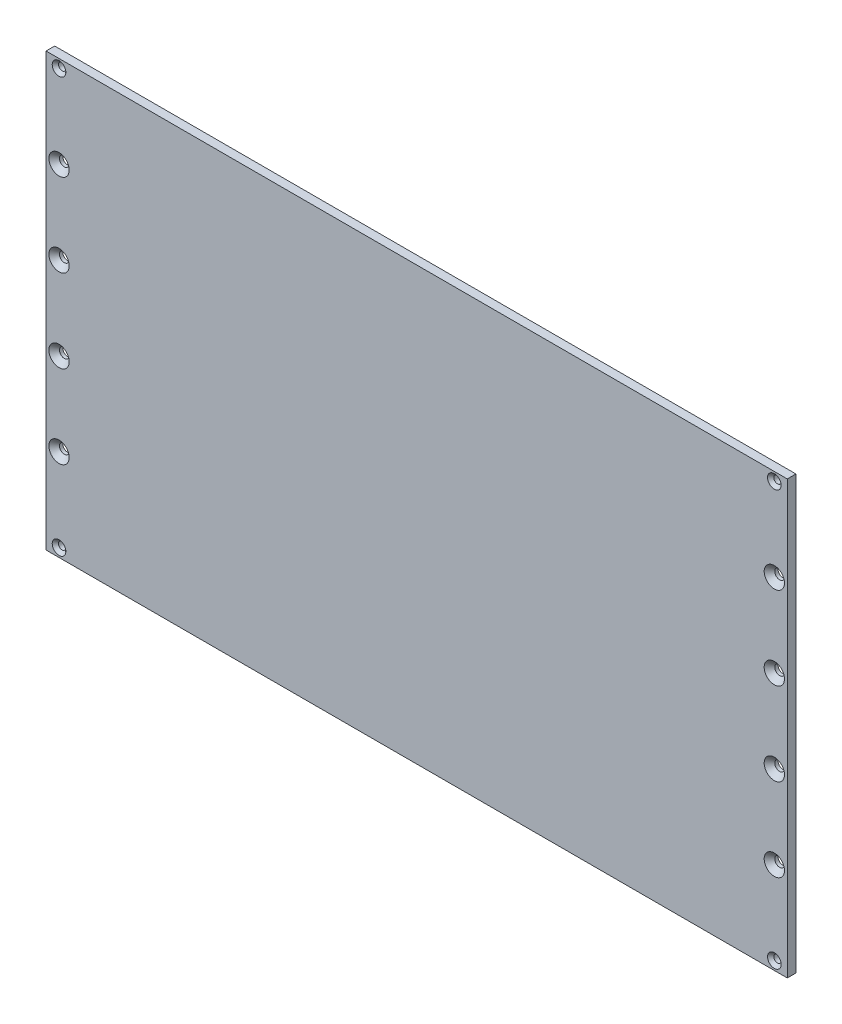
ISO-10303-21;
HEADER;
FILE_DESCRIPTION(('STEP AP214'),'2;1');
FILE_NAME('part.step','',(''),(''),'','','');
FILE_SCHEMA(('AUTOMOTIVE_DESIGN { 1 0 10303 214 1 1 1 1 }'));
ENDSEC;
DATA;
#1=APPLICATION_CONTEXT('core data for automotive mechanical design processes');
#2=APPLICATION_PROTOCOL_DEFINITION('international standard','automotive_design',2000,#1);
#3=PRODUCT_CONTEXT('',#1,'mechanical');
#4=PRODUCT('Part','Part','',(#3));
#5=PRODUCT_RELATED_PRODUCT_CATEGORY('part','',(#4));
#6=PRODUCT_DEFINITION_FORMATION('','',#4);
#7=PRODUCT_DEFINITION_CONTEXT('part definition',#1,'design');
#8=PRODUCT_DEFINITION('design','',#6,#7);
#9=PRODUCT_DEFINITION_SHAPE('','',#8);
#10=(LENGTH_UNIT() NAMED_UNIT(*) SI_UNIT(.MILLI.,.METRE.));
#11=(NAMED_UNIT(*) PLANE_ANGLE_UNIT() SI_UNIT($,.RADIAN.));
#12=(NAMED_UNIT(*) SI_UNIT($,.STERADIAN.) SOLID_ANGLE_UNIT());
#13=UNCERTAINTY_MEASURE_WITH_UNIT(LENGTH_MEASURE(1.E-05),#10,'distance_accuracy_value','');
#14=(GEOMETRIC_REPRESENTATION_CONTEXT(3) GLOBAL_UNCERTAINTY_ASSIGNED_CONTEXT((#13)) GLOBAL_UNIT_ASSIGNED_CONTEXT((#10,
#11,#12)) REPRESENTATION_CONTEXT('',''));
#15=CARTESIAN_POINT('',(0.,0.,0.));
#16=DIRECTION('',(0.,0.,1.));
#17=DIRECTION('',(1.,0.,0.));
#18=AXIS2_PLACEMENT_3D('',#15,#16,#17);
#19=CARTESIAN_POINT('',(0.,200.,0.));
#20=DIRECTION('',(0.,0.,-1.));
#21=DIRECTION('',(-1.,0.,0.));
#22=AXIS2_PLACEMENT_3D('',#19,#20,#21);
#23=PLANE('',#22);
#24=CARTESIAN_POINT('',(337.,157.6,0.));
#25=DIRECTION('',(0.,0.,1.));
#26=DIRECTION('',(1.,0.,0.));
#27=AXIS2_PLACEMENT_3D('',#24,#25,#26);
#28=CIRCLE('',#27,2.24999999999997);
#29=CARTESIAN_POINT('',(339.25,157.6,0.));
#30=VERTEX_POINT('',#29);
#31=EDGE_CURVE('E204',#30,#30,#28,.T.);
#32=ORIENTED_EDGE('',*,*,#31,.T.);
#33=EDGE_LOOP('',(#32));
#34=FACE_BOUND('',#33,.T.);
#35=CARTESIAN_POINT('',(337.,119.2,0.));
#36=DIRECTION('',(0.,0.,1.));
#37=DIRECTION('',(1.,0.,0.));
#38=AXIS2_PLACEMENT_3D('',#35,#36,#37);
#39=CIRCLE('',#38,2.24999999999997);
#40=CARTESIAN_POINT('',(339.25,119.2,0.));
#41=VERTEX_POINT('',#40);
#42=EDGE_CURVE('E186',#41,#41,#39,.T.);
#43=ORIENTED_EDGE('',*,*,#42,.T.);
#44=EDGE_LOOP('',(#43));
#45=FACE_BOUND('',#44,.T.);
#46=CARTESIAN_POINT('',(337.,80.8,0.));
#47=DIRECTION('',(0.,0.,1.));
#48=DIRECTION('',(1.,0.,0.));
#49=AXIS2_PLACEMENT_3D('',#46,#47,#48);
#50=CIRCLE('',#49,2.24999999999997);
#51=CARTESIAN_POINT('',(339.25,80.8,0.));
#52=VERTEX_POINT('',#51);
#53=EDGE_CURVE('E168',#52,#52,#50,.T.);
#54=ORIENTED_EDGE('',*,*,#53,.T.);
#55=EDGE_LOOP('',(#54));
#56=FACE_BOUND('',#55,.T.);
#57=CARTESIAN_POINT('',(337.,42.4,0.));
#58=DIRECTION('',(0.,0.,1.));
#59=DIRECTION('',(1.,0.,0.));
#60=AXIS2_PLACEMENT_3D('',#57,#58,#59);
#61=CIRCLE('',#60,2.24999999999997);
#62=CARTESIAN_POINT('',(339.25,42.4,0.));
#63=VERTEX_POINT('',#62);
#64=EDGE_CURVE('E150',#63,#63,#61,.T.);
#65=ORIENTED_EDGE('',*,*,#64,.T.);
#66=EDGE_LOOP('',(#65));
#67=FACE_BOUND('',#66,.T.);
#68=CARTESIAN_POINT('',(6.,4.,0.));
#69=DIRECTION('',(0.,0.,1.));
#70=DIRECTION('',(1.,0.,0.));
#71=AXIS2_PLACEMENT_3D('',#68,#69,#70);
#72=CIRCLE('',#71,1.7);
#73=CARTESIAN_POINT('',(7.7,4.,0.));
#74=VERTEX_POINT('',#73);
#75=EDGE_CURVE('E132',#74,#74,#72,.T.);
#76=ORIENTED_EDGE('',*,*,#75,.T.);
#77=EDGE_LOOP('',(#76));
#78=FACE_BOUND('',#77,.T.);
#79=CARTESIAN_POINT('',(337.,196.,0.));
#80=DIRECTION('',(0.,0.,1.));
#81=DIRECTION('',(1.,0.,0.));
#82=AXIS2_PLACEMENT_3D('',#79,#80,#81);
#83=CIRCLE('',#82,1.69999999999998);
#84=CARTESIAN_POINT('',(338.7,196.,0.));
#85=VERTEX_POINT('',#84);
#86=EDGE_CURVE('E114',#85,#85,#83,.T.);
#87=ORIENTED_EDGE('',*,*,#86,.T.);
#88=EDGE_LOOP('',(#87));
#89=FACE_BOUND('',#88,.T.);
#90=DIRECTION('',(0.,-1.,0.));
#91=VECTOR('',#90,1.);
#92=CARTESIAN_POINT('',(0.,0.,0.));
#93=LINE('',#92,#91);
#94=CARTESIAN_POINT('',(0.,200.,0.));
#95=VERTEX_POINT('',#94);
#96=CARTESIAN_POINT('',(0.,0.,0.));
#97=VERTEX_POINT('',#96);
#98=EDGE_CURVE('E95',#95,#97,#93,.T.);
#99=ORIENTED_EDGE('',*,*,#98,.F.);
#100=DIRECTION('',(-1.,0.,0.));
#101=VECTOR('',#100,1.);
#102=CARTESIAN_POINT('',(0.,200.,0.));
#103=LINE('',#102,#101);
#104=CARTESIAN_POINT('',(343.,200.,0.));
#105=VERTEX_POINT('',#104);
#106=EDGE_CURVE('E71',#105,#95,#103,.T.);
#107=ORIENTED_EDGE('',*,*,#106,.F.);
#108=DIRECTION('',(0.,1.,0.));
#109=VECTOR('',#108,1.);
#110=CARTESIAN_POINT('',(343.,0.,0.));
#111=LINE('',#110,#109);
#112=CARTESIAN_POINT('',(343.,0.,0.));
#113=VERTEX_POINT('',#112);
#114=EDGE_CURVE('E65',#113,#105,#111,.T.);
#115=ORIENTED_EDGE('',*,*,#114,.F.);
#116=DIRECTION('',(1.,0.,0.));
#117=VECTOR('',#116,1.);
#118=CARTESIAN_POINT('',(0.,0.,0.));
#119=LINE('',#118,#117);
#120=EDGE_CURVE('E87',#97,#113,#119,.T.);
#121=ORIENTED_EDGE('',*,*,#120,.F.);
#122=EDGE_LOOP('',(#99,#107,#115,#121));
#123=FACE_BOUND('',#122,.T.);
#124=CARTESIAN_POINT('',(337.,4.,0.));
#125=DIRECTION('',(0.,0.,1.));
#126=DIRECTION('',(1.,0.,0.));
#127=AXIS2_PLACEMENT_3D('',#124,#125,#126);
#128=CIRCLE('',#127,1.69999999999998);
#129=CARTESIAN_POINT('',(338.7,4.,0.));
#130=VERTEX_POINT('',#129);
#131=EDGE_CURVE('E123',#130,#130,#128,.T.);
#132=ORIENTED_EDGE('',*,*,#131,.T.);
#133=EDGE_LOOP('',(#132));
#134=FACE_BOUND('',#133,.T.);
#135=CARTESIAN_POINT('',(6.00000000000001,196.,0.));
#136=DIRECTION('',(0.,0.,1.));
#137=DIRECTION('',(1.,0.,0.));
#138=AXIS2_PLACEMENT_3D('',#135,#136,#137);
#139=CIRCLE('',#138,1.7);
#140=CARTESIAN_POINT('',(7.7,196.,0.));
#141=VERTEX_POINT('',#140);
#142=EDGE_CURVE('E141',#141,#141,#139,.T.);
#143=ORIENTED_EDGE('',*,*,#142,.T.);
#144=EDGE_LOOP('',(#143));
#145=FACE_BOUND('',#144,.T.);
#146=CARTESIAN_POINT('',(6.,42.4,0.));
#147=DIRECTION('',(0.,0.,1.));
#148=DIRECTION('',(1.,0.,0.));
#149=AXIS2_PLACEMENT_3D('',#146,#147,#148);
#150=CIRCLE('',#149,2.25);
#151=CARTESIAN_POINT('',(8.25,42.4,0.));
#152=VERTEX_POINT('',#151);
#153=EDGE_CURVE('E159',#152,#152,#150,.T.);
#154=ORIENTED_EDGE('',*,*,#153,.T.);
#155=EDGE_LOOP('',(#154));
#156=FACE_BOUND('',#155,.T.);
#157=CARTESIAN_POINT('',(6.,80.8,0.));
#158=DIRECTION('',(0.,0.,1.));
#159=DIRECTION('',(1.,0.,0.));
#160=AXIS2_PLACEMENT_3D('',#157,#158,#159);
#161=CIRCLE('',#160,2.25);
#162=CARTESIAN_POINT('',(8.25,80.8,0.));
#163=VERTEX_POINT('',#162);
#164=EDGE_CURVE('E177',#163,#163,#161,.T.);
#165=ORIENTED_EDGE('',*,*,#164,.T.);
#166=EDGE_LOOP('',(#165));
#167=FACE_BOUND('',#166,.T.);
#168=CARTESIAN_POINT('',(6.,119.2,0.));
#169=DIRECTION('',(0.,0.,1.));
#170=DIRECTION('',(1.,0.,0.));
#171=AXIS2_PLACEMENT_3D('',#168,#169,#170);
#172=CIRCLE('',#171,2.25);
#173=CARTESIAN_POINT('',(8.25,119.2,0.));
#174=VERTEX_POINT('',#173);
#175=EDGE_CURVE('E195',#174,#174,#172,.T.);
#176=ORIENTED_EDGE('',*,*,#175,.T.);
#177=EDGE_LOOP('',(#176));
#178=FACE_BOUND('',#177,.T.);
#179=CARTESIAN_POINT('',(6.,157.6,0.));
#180=DIRECTION('',(0.,0.,1.));
#181=DIRECTION('',(1.,0.,0.));
#182=AXIS2_PLACEMENT_3D('',#179,#180,#181);
#183=CIRCLE('',#182,2.25);
#184=CARTESIAN_POINT('',(8.25,157.6,0.));
#185=VERTEX_POINT('',#184);
#186=EDGE_CURVE('E213',#185,#185,#183,.T.);
#187=ORIENTED_EDGE('',*,*,#186,.T.);
#188=EDGE_LOOP('',(#187));
#189=FACE_BOUND('',#188,.T.);
#190=ADVANCED_FACE('F31',(#34,#45,#56,#67,#78,#89,#123,#134,#145,#156,#167,#178,#189),#23,.T.);
#191=CARTESIAN_POINT('',(0.,0.,4.));
#192=DIRECTION('',(1.,0.,0.));
#193=DIRECTION('',(0.,0.,-1.));
#194=AXIS2_PLACEMENT_3D('',#191,#192,#193);
#195=PLANE('',#194);
#196=ORIENTED_EDGE('',*,*,#98,.T.);
#197=DIRECTION('',(0.,0.,-1.));
#198=VECTOR('',#197,1.);
#199=CARTESIAN_POINT('',(0.,0.,4.));
#200=LINE('',#199,#198);
#201=CARTESIAN_POINT('',(0.,0.,4.));
#202=VERTEX_POINT('',#201);
#203=EDGE_CURVE('E11',#202,#97,#200,.T.);
#204=ORIENTED_EDGE('',*,*,#203,.F.);
#205=DIRECTION('',(0.,-1.,0.));
#206=VECTOR('',#205,1.);
#207=CARTESIAN_POINT('',(0.,0.,4.));
#208=LINE('',#207,#206);
#209=CARTESIAN_POINT('',(0.,200.,4.));
#210=VERTEX_POINT('',#209);
#211=EDGE_CURVE('E83',#210,#202,#208,.T.);
#212=ORIENTED_EDGE('',*,*,#211,.F.);
#213=DIRECTION('',(0.,0.,-1.));
#214=VECTOR('',#213,1.);
#215=CARTESIAN_POINT('',(0.,200.,4.));
#216=LINE('',#215,#214);
#217=EDGE_CURVE('E91',#210,#95,#216,.T.);
#218=ORIENTED_EDGE('',*,*,#217,.T.);
#219=EDGE_LOOP('',(#196,#204,#212,#218));
#220=FACE_BOUND('',#219,.T.);
#221=ADVANCED_FACE('F33',(#220),#195,.F.);
#222=CARTESIAN_POINT('',(0.,0.,4.));
#223=DIRECTION('',(0.,1.,0.));
#224=DIRECTION('',(0.,0.,1.));
#225=AXIS2_PLACEMENT_3D('',#222,#223,#224);
#226=PLANE('',#225);
#227=ORIENTED_EDGE('',*,*,#120,.T.);
#228=DIRECTION('',(0.,0.,-1.));
#229=VECTOR('',#228,1.);
#230=CARTESIAN_POINT('',(343.,0.,4.));
#231=LINE('',#230,#229);
#232=CARTESIAN_POINT('',(343.,0.,4.));
#233=VERTEX_POINT('',#232);
#234=EDGE_CURVE('E40',#233,#113,#231,.T.);
#235=ORIENTED_EDGE('',*,*,#234,.F.);
#236=DIRECTION('',(1.,0.,0.));
#237=VECTOR('',#236,1.);
#238=CARTESIAN_POINT('',(0.,0.,4.));
#239=LINE('',#238,#237);
#240=EDGE_CURVE('E78',#202,#233,#239,.T.);
#241=ORIENTED_EDGE('',*,*,#240,.F.);
#242=ORIENTED_EDGE('',*,*,#203,.T.);
#243=EDGE_LOOP('',(#227,#235,#241,#242));
#244=FACE_BOUND('',#243,.T.);
#245=ADVANCED_FACE('F86',(#244),#226,.F.);
#246=CARTESIAN_POINT('',(343.,0.,4.));
#247=DIRECTION('',(-1.,0.,0.));
#248=DIRECTION('',(0.,0.,1.));
#249=AXIS2_PLACEMENT_3D('',#246,#247,#248);
#250=PLANE('',#249);
#251=ORIENTED_EDGE('',*,*,#114,.T.);
#252=DIRECTION('',(0.,0.,-1.));
#253=VECTOR('',#252,1.);
#254=CARTESIAN_POINT('',(343.,200.,4.));
#255=LINE('',#254,#253);
#256=CARTESIAN_POINT('',(343.,200.,4.));
#257=VERTEX_POINT('',#256);
#258=EDGE_CURVE('E88',#257,#105,#255,.T.);
#259=ORIENTED_EDGE('',*,*,#258,.F.);
#260=DIRECTION('',(0.,1.,0.));
#261=VECTOR('',#260,1.);
#262=CARTESIAN_POINT('',(343.,0.,4.));
#263=LINE('',#262,#261);
#264=EDGE_CURVE('E81',#233,#257,#263,.T.);
#265=ORIENTED_EDGE('',*,*,#264,.F.);
#266=ORIENTED_EDGE('',*,*,#234,.T.);
#267=EDGE_LOOP('',(#251,#259,#265,#266));
#268=FACE_BOUND('',#267,.T.);
#269=ADVANCED_FACE('F89',(#268),#250,.F.);
#270=CARTESIAN_POINT('',(0.,200.,4.));
#271=DIRECTION('',(0.,-1.,0.));
#272=DIRECTION('',(0.,0.,-1.));
#273=AXIS2_PLACEMENT_3D('',#270,#271,#272);
#274=PLANE('',#273);
#275=ORIENTED_EDGE('',*,*,#106,.T.);
#276=ORIENTED_EDGE('',*,*,#217,.F.);
#277=DIRECTION('',(-1.,0.,0.));
#278=VECTOR('',#277,1.);
#279=CARTESIAN_POINT('',(0.,200.,4.));
#280=LINE('',#279,#278);
#281=EDGE_CURVE('E48',#257,#210,#280,.T.);
#282=ORIENTED_EDGE('',*,*,#281,.F.);
#283=ORIENTED_EDGE('',*,*,#258,.T.);
#284=EDGE_LOOP('',(#275,#276,#282,#283));
#285=FACE_BOUND('',#284,.T.);
#286=ADVANCED_FACE('F103',(#285),#274,.F.);
#287=CARTESIAN_POINT('',(0.,200.,4.));
#288=DIRECTION('',(0.,0.,-1.));
#289=DIRECTION('',(-1.,0.,0.));
#290=AXIS2_PLACEMENT_3D('',#287,#288,#289);
#291=PLANE('',#290);
#292=CARTESIAN_POINT('',(6.,157.6,4.));
#293=DIRECTION('',(0.,0.,1.));
#294=DIRECTION('',(1.,0.,0.));
#295=AXIS2_PLACEMENT_3D('',#292,#293,#294);
#296=CIRCLE('',#295,4.7);
#297=CARTESIAN_POINT('',(10.7,157.6,4.));
#298=VERTEX_POINT('',#297);
#299=EDGE_CURVE('E207',#298,#298,#296,.T.);
#300=ORIENTED_EDGE('',*,*,#299,.F.);
#301=EDGE_LOOP('',(#300));
#302=FACE_BOUND('',#301,.T.);
#303=CARTESIAN_POINT('',(337.,157.6,4.));
#304=DIRECTION('',(0.,0.,1.));
#305=DIRECTION('',(1.,0.,0.));
#306=AXIS2_PLACEMENT_3D('',#303,#304,#305);
#307=CIRCLE('',#306,4.69999999999998);
#308=CARTESIAN_POINT('',(341.7,157.6,4.));
#309=VERTEX_POINT('',#308);
#310=EDGE_CURVE('E198',#309,#309,#307,.T.);
#311=ORIENTED_EDGE('',*,*,#310,.F.);
#312=EDGE_LOOP('',(#311));
#313=FACE_BOUND('',#312,.T.);
#314=CARTESIAN_POINT('',(6.,119.2,4.));
#315=DIRECTION('',(0.,0.,1.));
#316=DIRECTION('',(1.,0.,0.));
#317=AXIS2_PLACEMENT_3D('',#314,#315,#316);
#318=CIRCLE('',#317,4.7);
#319=CARTESIAN_POINT('',(10.7,119.2,4.));
#320=VERTEX_POINT('',#319);
#321=EDGE_CURVE('E189',#320,#320,#318,.T.);
#322=ORIENTED_EDGE('',*,*,#321,.F.);
#323=EDGE_LOOP('',(#322));
#324=FACE_BOUND('',#323,.T.);
#325=CARTESIAN_POINT('',(337.,119.2,4.));
#326=DIRECTION('',(0.,0.,1.));
#327=DIRECTION('',(1.,0.,0.));
#328=AXIS2_PLACEMENT_3D('',#325,#326,#327);
#329=CIRCLE('',#328,4.69999999999998);
#330=CARTESIAN_POINT('',(341.7,119.2,4.));
#331=VERTEX_POINT('',#330);
#332=EDGE_CURVE('E180',#331,#331,#329,.T.);
#333=ORIENTED_EDGE('',*,*,#332,.F.);
#334=EDGE_LOOP('',(#333));
#335=FACE_BOUND('',#334,.T.);
#336=CARTESIAN_POINT('',(6.,80.8,4.));
#337=DIRECTION('',(0.,0.,1.));
#338=DIRECTION('',(1.,0.,0.));
#339=AXIS2_PLACEMENT_3D('',#336,#337,#338);
#340=CIRCLE('',#339,4.7);
#341=CARTESIAN_POINT('',(10.7,80.8,4.));
#342=VERTEX_POINT('',#341);
#343=EDGE_CURVE('E171',#342,#342,#340,.T.);
#344=ORIENTED_EDGE('',*,*,#343,.F.);
#345=EDGE_LOOP('',(#344));
#346=FACE_BOUND('',#345,.T.);
#347=CARTESIAN_POINT('',(337.,80.8,4.));
#348=DIRECTION('',(0.,0.,1.));
#349=DIRECTION('',(1.,0.,0.));
#350=AXIS2_PLACEMENT_3D('',#347,#348,#349);
#351=CIRCLE('',#350,4.69999999999998);
#352=CARTESIAN_POINT('',(341.7,80.8,4.));
#353=VERTEX_POINT('',#352);
#354=EDGE_CURVE('E162',#353,#353,#351,.T.);
#355=ORIENTED_EDGE('',*,*,#354,.F.);
#356=EDGE_LOOP('',(#355));
#357=FACE_BOUND('',#356,.T.);
#358=CARTESIAN_POINT('',(6.,42.4,4.));
#359=DIRECTION('',(0.,0.,1.));
#360=DIRECTION('',(1.,0.,0.));
#361=AXIS2_PLACEMENT_3D('',#358,#359,#360);
#362=CIRCLE('',#361,4.7);
#363=CARTESIAN_POINT('',(10.7,42.4,4.));
#364=VERTEX_POINT('',#363);
#365=EDGE_CURVE('E153',#364,#364,#362,.T.);
#366=ORIENTED_EDGE('',*,*,#365,.F.);
#367=EDGE_LOOP('',(#366));
#368=FACE_BOUND('',#367,.T.);
#369=CARTESIAN_POINT('',(337.,42.4,4.));
#370=DIRECTION('',(0.,0.,1.));
#371=DIRECTION('',(1.,0.,0.));
#372=AXIS2_PLACEMENT_3D('',#369,#370,#371);
#373=CIRCLE('',#372,4.69999999999998);
#374=CARTESIAN_POINT('',(341.7,42.4,4.));
#375=VERTEX_POINT('',#374);
#376=EDGE_CURVE('E144',#375,#375,#373,.T.);
#377=ORIENTED_EDGE('',*,*,#376,.F.);
#378=EDGE_LOOP('',(#377));
#379=FACE_BOUND('',#378,.T.);
#380=CARTESIAN_POINT('',(6.00000000000001,196.,4.));
#381=DIRECTION('',(0.,0.,1.));
#382=DIRECTION('',(1.,0.,0.));
#383=AXIS2_PLACEMENT_3D('',#380,#381,#382);
#384=CIRCLE('',#383,3.15);
#385=CARTESIAN_POINT('',(9.15000000000001,196.,4.));
#386=VERTEX_POINT('',#385);
#387=EDGE_CURVE('E135',#386,#386,#384,.T.);
#388=ORIENTED_EDGE('',*,*,#387,.F.);
#389=EDGE_LOOP('',(#388));
#390=FACE_BOUND('',#389,.T.);
#391=CARTESIAN_POINT('',(6.,4.,4.));
#392=DIRECTION('',(0.,0.,1.));
#393=DIRECTION('',(1.,0.,0.));
#394=AXIS2_PLACEMENT_3D('',#391,#392,#393);
#395=CIRCLE('',#394,3.15);
#396=CARTESIAN_POINT('',(9.15,4.,4.));
#397=VERTEX_POINT('',#396);
#398=EDGE_CURVE('E126',#397,#397,#395,.T.);
#399=ORIENTED_EDGE('',*,*,#398,.F.);
#400=EDGE_LOOP('',(#399));
#401=FACE_BOUND('',#400,.T.);
#402=CARTESIAN_POINT('',(337.,4.,4.));
#403=DIRECTION('',(0.,0.,1.));
#404=DIRECTION('',(1.,0.,0.));
#405=AXIS2_PLACEMENT_3D('',#402,#403,#404);
#406=CIRCLE('',#405,3.14999999999999);
#407=CARTESIAN_POINT('',(340.15,4.,4.));
#408=VERTEX_POINT('',#407);
#409=EDGE_CURVE('E117',#408,#408,#406,.T.);
#410=ORIENTED_EDGE('',*,*,#409,.F.);
#411=EDGE_LOOP('',(#410));
#412=FACE_BOUND('',#411,.T.);
#413=CARTESIAN_POINT('',(337.,196.,4.));
#414=DIRECTION('',(0.,0.,1.));
#415=DIRECTION('',(1.,0.,0.));
#416=AXIS2_PLACEMENT_3D('',#413,#414,#415);
#417=CIRCLE('',#416,3.14999999999999);
#418=CARTESIAN_POINT('',(340.15,196.,4.));
#419=VERTEX_POINT('',#418);
#420=EDGE_CURVE('E98',#419,#419,#417,.T.);
#421=ORIENTED_EDGE('',*,*,#420,.F.);
#422=EDGE_LOOP('',(#421));
#423=FACE_BOUND('',#422,.T.);
#424=ORIENTED_EDGE('',*,*,#211,.T.);
#425=ORIENTED_EDGE('',*,*,#240,.T.);
#426=ORIENTED_EDGE('',*,*,#264,.T.);
#427=ORIENTED_EDGE('',*,*,#281,.T.);
#428=EDGE_LOOP('',(#424,#425,#426,#427));
#429=FACE_BOUND('',#428,.T.);
#430=ADVANCED_FACE('F79',(#302,#313,#324,#335,#346,#357,#368,#379,#390,#401,#412,#423,#429),
#291,.F.);
#431=CARTESIAN_POINT('',(337.,196.,4.));
#432=DIRECTION('',(0.,0.,1.));
#433=DIRECTION('',(1.,0.,0.));
#434=AXIS2_PLACEMENT_3D('',#431,#432,#433);
#435=CONICAL_SURFACE('',#434,3.14999999999999,0.785398163397451);
#436=CARTESIAN_POINT('',(337.,196.,2.55));
#437=DIRECTION('',(0.,0.,1.));
#438=DIRECTION('',(1.,0.,0.));
#439=AXIS2_PLACEMENT_3D('',#436,#437,#438);
#440=CIRCLE('',#439,1.69999999999998);
#441=CARTESIAN_POINT('',(338.7,196.,2.55));
#442=VERTEX_POINT('',#441);
#443=EDGE_CURVE('E111',#442,#442,#440,.T.);
#444=ORIENTED_EDGE('',*,*,#443,.F.);
#445=EDGE_LOOP('',(#444));
#446=FACE_BOUND('',#445,.T.);
#447=ORIENTED_EDGE('',*,*,#420,.T.);
#448=EDGE_LOOP('',(#447));
#449=FACE_BOUND('',#448,.T.);
#450=ADVANCED_FACE('F233',(#446,#449),#435,.F.);
#451=CARTESIAN_POINT('',(337.,196.,4.));
#452=DIRECTION('',(0.,0.,1.));
#453=DIRECTION('',(1.,0.,0.));
#454=AXIS2_PLACEMENT_3D('',#451,#452,#453);
#455=CYLINDRICAL_SURFACE('',#454,1.69999999999998);
#456=ORIENTED_EDGE('',*,*,#86,.F.);
#457=EDGE_LOOP('',(#456));
#458=FACE_BOUND('',#457,.T.);
#459=ORIENTED_EDGE('',*,*,#443,.T.);
#460=EDGE_LOOP('',(#459));
#461=FACE_BOUND('',#460,.T.);
#462=ADVANCED_FACE('F258',(#458,#461),#455,.F.);
#463=CARTESIAN_POINT('',(337.,4.,4.));
#464=DIRECTION('',(0.,0.,1.));
#465=DIRECTION('',(1.,0.,0.));
#466=AXIS2_PLACEMENT_3D('',#463,#464,#465);
#467=CONICAL_SURFACE('',#466,3.14999999999999,0.785398163397451);
#468=CARTESIAN_POINT('',(337.,4.,2.55));
#469=DIRECTION('',(0.,0.,1.));
#470=DIRECTION('',(1.,0.,0.));
#471=AXIS2_PLACEMENT_3D('',#468,#469,#470);
#472=CIRCLE('',#471,1.69999999999998);
#473=CARTESIAN_POINT('',(338.7,4.,2.55));
#474=VERTEX_POINT('',#473);
#475=EDGE_CURVE('E120',#474,#474,#472,.T.);
#476=ORIENTED_EDGE('',*,*,#475,.F.);
#477=EDGE_LOOP('',(#476));
#478=FACE_BOUND('',#477,.T.);
#479=ORIENTED_EDGE('',*,*,#409,.T.);
#480=EDGE_LOOP('',(#479));
#481=FACE_BOUND('',#480,.T.);
#482=ADVANCED_FACE('F264',(#478,#481),#467,.F.);
#483=CARTESIAN_POINT('',(337.,4.,4.));
#484=DIRECTION('',(0.,0.,1.));
#485=DIRECTION('',(1.,0.,0.));
#486=AXIS2_PLACEMENT_3D('',#483,#484,#485);
#487=CYLINDRICAL_SURFACE('',#486,1.69999999999998);
#488=ORIENTED_EDGE('',*,*,#131,.F.);
#489=EDGE_LOOP('',(#488));
#490=FACE_BOUND('',#489,.T.);
#491=ORIENTED_EDGE('',*,*,#475,.T.);
#492=EDGE_LOOP('',(#491));
#493=FACE_BOUND('',#492,.T.);
#494=ADVANCED_FACE('F449',(#490,#493),#487,.F.);
#495=CARTESIAN_POINT('',(6.,4.,4.));
#496=DIRECTION('',(0.,0.,1.));
#497=DIRECTION('',(1.,0.,0.));
#498=AXIS2_PLACEMENT_3D('',#495,#496,#497);
#499=CONICAL_SURFACE('',#498,3.15,0.785398163397449);
#500=CARTESIAN_POINT('',(6.,4.,2.55));
#501=DIRECTION('',(0.,0.,1.));
#502=DIRECTION('',(1.,0.,0.));
#503=AXIS2_PLACEMENT_3D('',#500,#501,#502);
#504=CIRCLE('',#503,1.7);
#505=CARTESIAN_POINT('',(7.7,4.,2.55));
#506=VERTEX_POINT('',#505);
#507=EDGE_CURVE('E129',#506,#506,#504,.T.);
#508=ORIENTED_EDGE('',*,*,#507,.F.);
#509=EDGE_LOOP('',(#508));
#510=FACE_BOUND('',#509,.T.);
#511=ORIENTED_EDGE('',*,*,#398,.T.);
#512=EDGE_LOOP('',(#511));
#513=FACE_BOUND('',#512,.T.);
#514=ADVANCED_FACE('F445',(#510,#513),#499,.F.);
#515=CARTESIAN_POINT('',(6.,4.,4.));
#516=DIRECTION('',(0.,0.,1.));
#517=DIRECTION('',(1.,0.,0.));
#518=AXIS2_PLACEMENT_3D('',#515,#516,#517);
#519=CYLINDRICAL_SURFACE('',#518,1.7);
#520=ORIENTED_EDGE('',*,*,#75,.F.);
#521=EDGE_LOOP('',(#520));
#522=FACE_BOUND('',#521,.T.);
#523=ORIENTED_EDGE('',*,*,#507,.T.);
#524=EDGE_LOOP('',(#523));
#525=FACE_BOUND('',#524,.T.);
#526=ADVANCED_FACE('F441',(#522,#525),#519,.F.);
#527=CARTESIAN_POINT('',(6.00000000000001,196.,4.));
#528=DIRECTION('',(0.,0.,1.));
#529=DIRECTION('',(1.,0.,0.));
#530=AXIS2_PLACEMENT_3D('',#527,#528,#529);
#531=CONICAL_SURFACE('',#530,3.15,0.785398163397449);
#532=CARTESIAN_POINT('',(6.00000000000001,196.,2.55));
#533=DIRECTION('',(0.,0.,1.));
#534=DIRECTION('',(1.,0.,0.));
#535=AXIS2_PLACEMENT_3D('',#532,#533,#534);
#536=CIRCLE('',#535,1.7);
#537=CARTESIAN_POINT('',(7.7,196.,2.55));
#538=VERTEX_POINT('',#537);
#539=EDGE_CURVE('E138',#538,#538,#536,.T.);
#540=ORIENTED_EDGE('',*,*,#539,.F.);
#541=EDGE_LOOP('',(#540));
#542=FACE_BOUND('',#541,.T.);
#543=ORIENTED_EDGE('',*,*,#387,.T.);
#544=EDGE_LOOP('',(#543));
#545=FACE_BOUND('',#544,.T.);
#546=ADVANCED_FACE('F437',(#542,#545),#531,.F.);
#547=CARTESIAN_POINT('',(6.00000000000001,196.,4.));
#548=DIRECTION('',(0.,0.,1.));
#549=DIRECTION('',(1.,0.,0.));
#550=AXIS2_PLACEMENT_3D('',#547,#548,#549);
#551=CYLINDRICAL_SURFACE('',#550,1.7);
#552=ORIENTED_EDGE('',*,*,#142,.F.);
#553=EDGE_LOOP('',(#552));
#554=FACE_BOUND('',#553,.T.);
#555=ORIENTED_EDGE('',*,*,#539,.T.);
#556=EDGE_LOOP('',(#555));
#557=FACE_BOUND('',#556,.T.);
#558=ADVANCED_FACE('F433',(#554,#557),#551,.F.);
#559=CARTESIAN_POINT('',(337.,42.4,4.));
#560=DIRECTION('',(0.,0.,1.));
#561=DIRECTION('',(1.,0.,0.));
#562=AXIS2_PLACEMENT_3D('',#559,#560,#561);
#563=CONICAL_SURFACE('',#562,4.69999999999998,0.785398163397449);
#564=CARTESIAN_POINT('',(337.,42.4,1.55));
#565=DIRECTION('',(0.,0.,1.));
#566=DIRECTION('',(1.,0.,0.));
#567=AXIS2_PLACEMENT_3D('',#564,#565,#566);
#568=CIRCLE('',#567,2.24999999999997);
#569=CARTESIAN_POINT('',(339.25,42.4,1.55));
#570=VERTEX_POINT('',#569);
#571=EDGE_CURVE('E147',#570,#570,#568,.T.);
#572=ORIENTED_EDGE('',*,*,#571,.F.);
#573=EDGE_LOOP('',(#572));
#574=FACE_BOUND('',#573,.T.);
#575=ORIENTED_EDGE('',*,*,#376,.T.);
#576=EDGE_LOOP('',(#575));
#577=FACE_BOUND('',#576,.T.);
#578=ADVANCED_FACE('F429',(#574,#577),#563,.F.);
#579=CARTESIAN_POINT('',(337.,42.4,4.));
#580=DIRECTION('',(0.,0.,1.));
#581=DIRECTION('',(1.,0.,0.));
#582=AXIS2_PLACEMENT_3D('',#579,#580,#581);
#583=CYLINDRICAL_SURFACE('',#582,2.24999999999997);
#584=ORIENTED_EDGE('',*,*,#64,.F.);
#585=EDGE_LOOP('',(#584));
#586=FACE_BOUND('',#585,.T.);
#587=ORIENTED_EDGE('',*,*,#571,.T.);
#588=EDGE_LOOP('',(#587));
#589=FACE_BOUND('',#588,.T.);
#590=ADVANCED_FACE('F425',(#586,#589),#583,.F.);
#591=CARTESIAN_POINT('',(6.,42.4,4.));
#592=DIRECTION('',(0.,0.,1.));
#593=DIRECTION('',(1.,0.,0.));
#594=AXIS2_PLACEMENT_3D('',#591,#592,#593);
#595=CONICAL_SURFACE('',#594,4.7,0.785398163397448);
#596=CARTESIAN_POINT('',(6.,42.4,1.55));
#597=DIRECTION('',(0.,0.,1.));
#598=DIRECTION('',(1.,0.,0.));
#599=AXIS2_PLACEMENT_3D('',#596,#597,#598);
#600=CIRCLE('',#599,2.25);
#601=CARTESIAN_POINT('',(8.25,42.4,1.55));
#602=VERTEX_POINT('',#601);
#603=EDGE_CURVE('E156',#602,#602,#600,.T.);
#604=ORIENTED_EDGE('',*,*,#603,.F.);
#605=EDGE_LOOP('',(#604));
#606=FACE_BOUND('',#605,.T.);
#607=ORIENTED_EDGE('',*,*,#365,.T.);
#608=EDGE_LOOP('',(#607));
#609=FACE_BOUND('',#608,.T.);
#610=ADVANCED_FACE('F421',(#606,#609),#595,.F.);
#611=CARTESIAN_POINT('',(6.,42.4,4.));
#612=DIRECTION('',(0.,0.,1.));
#613=DIRECTION('',(1.,0.,0.));
#614=AXIS2_PLACEMENT_3D('',#611,#612,#613);
#615=CYLINDRICAL_SURFACE('',#614,2.25);
#616=ORIENTED_EDGE('',*,*,#153,.F.);
#617=EDGE_LOOP('',(#616));
#618=FACE_BOUND('',#617,.T.);
#619=ORIENTED_EDGE('',*,*,#603,.T.);
#620=EDGE_LOOP('',(#619));
#621=FACE_BOUND('',#620,.T.);
#622=ADVANCED_FACE('F311',(#618,#621),#615,.F.);
#623=CARTESIAN_POINT('',(337.,80.8,4.));
#624=DIRECTION('',(0.,0.,1.));
#625=DIRECTION('',(1.,0.,0.));
#626=AXIS2_PLACEMENT_3D('',#623,#624,#625);
#627=CONICAL_SURFACE('',#626,4.69999999999998,0.785398163397449);
#628=CARTESIAN_POINT('',(337.,80.8,1.55));
#629=DIRECTION('',(0.,0.,1.));
#630=DIRECTION('',(1.,0.,0.));
#631=AXIS2_PLACEMENT_3D('',#628,#629,#630);
#632=CIRCLE('',#631,2.24999999999997);
#633=CARTESIAN_POINT('',(339.25,80.8,1.55));
#634=VERTEX_POINT('',#633);
#635=EDGE_CURVE('E165',#634,#634,#632,.T.);
#636=ORIENTED_EDGE('',*,*,#635,.F.);
#637=EDGE_LOOP('',(#636));
#638=FACE_BOUND('',#637,.T.);
#639=ORIENTED_EDGE('',*,*,#354,.T.);
#640=EDGE_LOOP('',(#639));
#641=FACE_BOUND('',#640,.T.);
#642=ADVANCED_FACE('F305',(#638,#641),#627,.F.);
#643=CARTESIAN_POINT('',(337.,80.8,4.));
#644=DIRECTION('',(0.,0.,1.));
#645=DIRECTION('',(1.,0.,0.));
#646=AXIS2_PLACEMENT_3D('',#643,#644,#645);
#647=CYLINDRICAL_SURFACE('',#646,2.24999999999997);
#648=ORIENTED_EDGE('',*,*,#53,.F.);
#649=EDGE_LOOP('',(#648));
#650=FACE_BOUND('',#649,.T.);
#651=ORIENTED_EDGE('',*,*,#635,.T.);
#652=EDGE_LOOP('',(#651));
#653=FACE_BOUND('',#652,.T.);
#654=ADVANCED_FACE('F310',(#650,#653),#647,.F.);
#655=CARTESIAN_POINT('',(6.,80.8,4.));
#656=DIRECTION('',(0.,0.,1.));
#657=DIRECTION('',(1.,0.,0.));
#658=AXIS2_PLACEMENT_3D('',#655,#656,#657);
#659=CONICAL_SURFACE('',#658,4.7,0.785398163397448);
#660=CARTESIAN_POINT('',(6.,80.8,1.55));
#661=DIRECTION('',(0.,0.,1.));
#662=DIRECTION('',(1.,0.,0.));
#663=AXIS2_PLACEMENT_3D('',#660,#661,#662);
#664=CIRCLE('',#663,2.25);
#665=CARTESIAN_POINT('',(8.25,80.8,1.55));
#666=VERTEX_POINT('',#665);
#667=EDGE_CURVE('E174',#666,#666,#664,.T.);
#668=ORIENTED_EDGE('',*,*,#667,.F.);
#669=EDGE_LOOP('',(#668));
#670=FACE_BOUND('',#669,.T.);
#671=ORIENTED_EDGE('',*,*,#343,.T.);
#672=EDGE_LOOP('',(#671));
#673=FACE_BOUND('',#672,.T.);
#674=ADVANCED_FACE('F322',(#670,#673),#659,.F.);
#675=CARTESIAN_POINT('',(6.,80.8,4.));
#676=DIRECTION('',(0.,0.,1.));
#677=DIRECTION('',(1.,0.,0.));
#678=AXIS2_PLACEMENT_3D('',#675,#676,#677);
#679=CYLINDRICAL_SURFACE('',#678,2.25);
#680=ORIENTED_EDGE('',*,*,#164,.F.);
#681=EDGE_LOOP('',(#680));
#682=FACE_BOUND('',#681,.T.);
#683=ORIENTED_EDGE('',*,*,#667,.T.);
#684=EDGE_LOOP('',(#683));
#685=FACE_BOUND('',#684,.T.);
#686=ADVANCED_FACE('F332',(#682,#685),#679,.F.);
#687=CARTESIAN_POINT('',(337.,119.2,4.));
#688=DIRECTION('',(0.,0.,1.));
#689=DIRECTION('',(1.,0.,0.));
#690=AXIS2_PLACEMENT_3D('',#687,#688,#689);
#691=CONICAL_SURFACE('',#690,4.69999999999998,0.785398163397449);
#692=CARTESIAN_POINT('',(337.,119.2,1.55));
#693=DIRECTION('',(0.,0.,1.));
#694=DIRECTION('',(1.,0.,0.));
#695=AXIS2_PLACEMENT_3D('',#692,#693,#694);
#696=CIRCLE('',#695,2.24999999999997);
#697=CARTESIAN_POINT('',(339.25,119.2,1.55));
#698=VERTEX_POINT('',#697);
#699=EDGE_CURVE('E183',#698,#698,#696,.T.);
#700=ORIENTED_EDGE('',*,*,#699,.F.);
#701=EDGE_LOOP('',(#700));
#702=FACE_BOUND('',#701,.T.);
#703=ORIENTED_EDGE('',*,*,#332,.T.);
#704=EDGE_LOOP('',(#703));
#705=FACE_BOUND('',#704,.T.);
#706=ADVANCED_FACE('F342',(#702,#705),#691,.F.);
#707=CARTESIAN_POINT('',(337.,119.2,4.));
#708=DIRECTION('',(0.,0.,1.));
#709=DIRECTION('',(1.,0.,0.));
#710=AXIS2_PLACEMENT_3D('',#707,#708,#709);
#711=CYLINDRICAL_SURFACE('',#710,2.24999999999997);
#712=ORIENTED_EDGE('',*,*,#42,.F.);
#713=EDGE_LOOP('',(#712));
#714=FACE_BOUND('',#713,.T.);
#715=ORIENTED_EDGE('',*,*,#699,.T.);
#716=EDGE_LOOP('',(#715));
#717=FACE_BOUND('',#716,.T.);
#718=ADVANCED_FACE('F352',(#714,#717),#711,.F.);
#719=CARTESIAN_POINT('',(6.,119.2,4.));
#720=DIRECTION('',(0.,0.,1.));
#721=DIRECTION('',(1.,0.,0.));
#722=AXIS2_PLACEMENT_3D('',#719,#720,#721);
#723=CONICAL_SURFACE('',#722,4.7,0.785398163397448);
#724=CARTESIAN_POINT('',(6.,119.2,1.55));
#725=DIRECTION('',(0.,0.,1.));
#726=DIRECTION('',(1.,0.,0.));
#727=AXIS2_PLACEMENT_3D('',#724,#725,#726);
#728=CIRCLE('',#727,2.25);
#729=CARTESIAN_POINT('',(8.25,119.2,1.55));
#730=VERTEX_POINT('',#729);
#731=EDGE_CURVE('E192',#730,#730,#728,.T.);
#732=ORIENTED_EDGE('',*,*,#731,.F.);
#733=EDGE_LOOP('',(#732));
#734=FACE_BOUND('',#733,.T.);
#735=ORIENTED_EDGE('',*,*,#321,.T.);
#736=EDGE_LOOP('',(#735));
#737=FACE_BOUND('',#736,.T.);
#738=ADVANCED_FACE('F362',(#734,#737),#723,.F.);
#739=CARTESIAN_POINT('',(6.,119.2,4.));
#740=DIRECTION('',(0.,0.,1.));
#741=DIRECTION('',(1.,0.,0.));
#742=AXIS2_PLACEMENT_3D('',#739,#740,#741);
#743=CYLINDRICAL_SURFACE('',#742,2.25);
#744=ORIENTED_EDGE('',*,*,#175,.F.);
#745=EDGE_LOOP('',(#744));
#746=FACE_BOUND('',#745,.T.);
#747=ORIENTED_EDGE('',*,*,#731,.T.);
#748=EDGE_LOOP('',(#747));
#749=FACE_BOUND('',#748,.T.);
#750=ADVANCED_FACE('F372',(#746,#749),#743,.F.);
#751=CARTESIAN_POINT('',(337.,157.6,4.));
#752=DIRECTION('',(0.,0.,1.));
#753=DIRECTION('',(1.,0.,0.));
#754=AXIS2_PLACEMENT_3D('',#751,#752,#753);
#755=CONICAL_SURFACE('',#754,4.69999999999998,0.785398163397449);
#756=CARTESIAN_POINT('',(337.,157.6,1.55));
#757=DIRECTION('',(0.,0.,1.));
#758=DIRECTION('',(1.,0.,0.));
#759=AXIS2_PLACEMENT_3D('',#756,#757,#758);
#760=CIRCLE('',#759,2.24999999999997);
#761=CARTESIAN_POINT('',(339.25,157.6,1.55));
#762=VERTEX_POINT('',#761);
#763=EDGE_CURVE('E201',#762,#762,#760,.T.);
#764=ORIENTED_EDGE('',*,*,#763,.F.);
#765=EDGE_LOOP('',(#764));
#766=FACE_BOUND('',#765,.T.);
#767=ORIENTED_EDGE('',*,*,#310,.T.);
#768=EDGE_LOOP('',(#767));
#769=FACE_BOUND('',#768,.T.);
#770=ADVANCED_FACE('F382',(#766,#769),#755,.F.);
#771=CARTESIAN_POINT('',(337.,157.6,4.));
#772=DIRECTION('',(0.,0.,1.));
#773=DIRECTION('',(1.,0.,0.));
#774=AXIS2_PLACEMENT_3D('',#771,#772,#773);
#775=CYLINDRICAL_SURFACE('',#774,2.24999999999997);
#776=ORIENTED_EDGE('',*,*,#31,.F.);
#777=EDGE_LOOP('',(#776));
#778=FACE_BOUND('',#777,.T.);
#779=ORIENTED_EDGE('',*,*,#763,.T.);
#780=EDGE_LOOP('',(#779));
#781=FACE_BOUND('',#780,.T.);
#782=ADVANCED_FACE('F227',(#778,#781),#775,.F.);
#783=CARTESIAN_POINT('',(6.,157.6,4.));
#784=DIRECTION('',(0.,0.,1.));
#785=DIRECTION('',(1.,0.,0.));
#786=AXIS2_PLACEMENT_3D('',#783,#784,#785);
#787=CONICAL_SURFACE('',#786,4.7,0.785398163397448);
#788=CARTESIAN_POINT('',(6.,157.6,1.55));
#789=DIRECTION('',(0.,0.,1.));
#790=DIRECTION('',(1.,0.,0.));
#791=AXIS2_PLACEMENT_3D('',#788,#789,#790);
#792=CIRCLE('',#791,2.25);
#793=CARTESIAN_POINT('',(8.25,157.6,1.55));
#794=VERTEX_POINT('',#793);
#795=EDGE_CURVE('E210',#794,#794,#792,.T.);
#796=ORIENTED_EDGE('',*,*,#795,.F.);
#797=EDGE_LOOP('',(#796));
#798=FACE_BOUND('',#797,.T.);
#799=ORIENTED_EDGE('',*,*,#299,.T.);
#800=EDGE_LOOP('',(#799));
#801=FACE_BOUND('',#800,.T.);
#802=ADVANCED_FACE('F221',(#798,#801),#787,.F.);
#803=CARTESIAN_POINT('',(6.,157.6,4.));
#804=DIRECTION('',(0.,0.,1.));
#805=DIRECTION('',(1.,0.,0.));
#806=AXIS2_PLACEMENT_3D('',#803,#804,#805);
#807=CYLINDRICAL_SURFACE('',#806,2.25);
#808=ORIENTED_EDGE('',*,*,#186,.F.);
#809=EDGE_LOOP('',(#808));
#810=FACE_BOUND('',#809,.T.);
#811=ORIENTED_EDGE('',*,*,#795,.T.);
#812=EDGE_LOOP('',(#811));
#813=FACE_BOUND('',#812,.T.);
#814=ADVANCED_FACE('F218',(#810,#813),#807,.F.);
#815=CLOSED_SHELL('',(#190,#221,#245,#269,#286,#430,#450,#462,#482,#494,#514,#526,#546,#558,
#578,#590,#610,#622,#642,#654,#674,#686,#706,#718,#738,#750,#770,#782,#802,#814));
#816=MANIFOLD_SOLID_BREP('B2',#815);
#817=ADVANCED_BREP_SHAPE_REPRESENTATION('',(#18,#816),#14);
#818=SHAPE_DEFINITION_REPRESENTATION(#9,#817);
ENDSEC;
END-ISO-10303-21;
